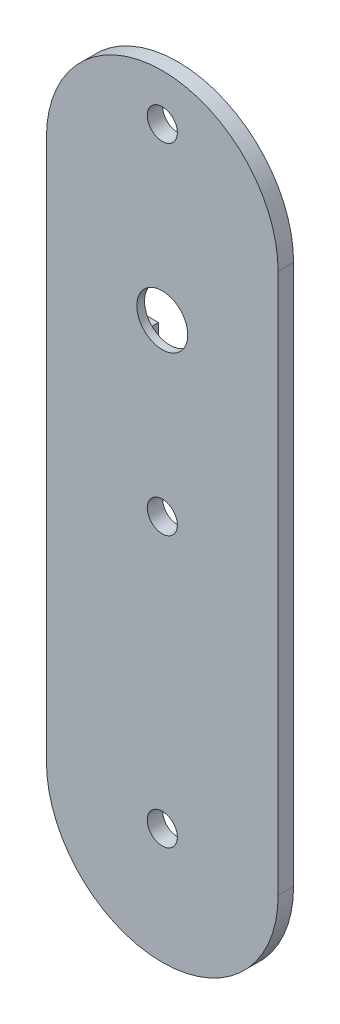
ISO-10303-21;
HEADER;
FILE_DESCRIPTION(('STEP AP214'),'2;1');
FILE_NAME('part.step','',(''),(''),'','','');
FILE_SCHEMA(('AUTOMOTIVE_DESIGN { 1 0 10303 214 1 1 1 1 }'));
ENDSEC;
DATA;
#1=APPLICATION_CONTEXT('core data for automotive mechanical design processes');
#2=APPLICATION_PROTOCOL_DEFINITION('international standard','automotive_design',2000,#1);
#3=PRODUCT_CONTEXT('',#1,'mechanical');
#4=PRODUCT('Part','Part','',(#3));
#5=PRODUCT_RELATED_PRODUCT_CATEGORY('part','',(#4));
#6=PRODUCT_DEFINITION_FORMATION('','',#4);
#7=PRODUCT_DEFINITION_CONTEXT('part definition',#1,'design');
#8=PRODUCT_DEFINITION('design','',#6,#7);
#9=PRODUCT_DEFINITION_SHAPE('','',#8);
#10=(LENGTH_UNIT() NAMED_UNIT(*) SI_UNIT(.MILLI.,.METRE.));
#11=(NAMED_UNIT(*) PLANE_ANGLE_UNIT() SI_UNIT($,.RADIAN.));
#12=(NAMED_UNIT(*) SI_UNIT($,.STERADIAN.) SOLID_ANGLE_UNIT());
#13=UNCERTAINTY_MEASURE_WITH_UNIT(LENGTH_MEASURE(1.E-05),#10,'distance_accuracy_value','');
#14=(GEOMETRIC_REPRESENTATION_CONTEXT(3) GLOBAL_UNCERTAINTY_ASSIGNED_CONTEXT((#13)) GLOBAL_UNIT_ASSIGNED_CONTEXT((#10,
#11,#12)) REPRESENTATION_CONTEXT('',''));
#15=CARTESIAN_POINT('',(0.,0.,0.));
#16=DIRECTION('',(0.,0.,1.));
#17=DIRECTION('',(1.,0.,0.));
#18=AXIS2_PLACEMENT_3D('',#15,#16,#17);
#19=CARTESIAN_POINT('',(0.,0.,0.));
#20=DIRECTION('',(0.,0.,1.));
#21=DIRECTION('',(1.,0.,0.));
#22=AXIS2_PLACEMENT_3D('',#19,#20,#21);
#23=PLANE('',#22);
#24=CARTESIAN_POINT('',(15.,0.,0.));
#25=DIRECTION('',(0.,0.,-1.));
#26=DIRECTION('',(-1.,0.,0.));
#27=AXIS2_PLACEMENT_3D('',#24,#25,#26);
#28=CIRCLE('',#27,1.94999999999999);
#29=CARTESIAN_POINT('',(13.05,0.,0.));
#30=VERTEX_POINT('',#29);
#31=EDGE_CURVE('E534',#30,#30,#28,.T.);
#32=ORIENTED_EDGE('',*,*,#31,.F.);
#33=EDGE_LOOP('',(#32));
#34=FACE_BOUND('',#33,.T.);
#35=CARTESIAN_POINT('',(15.,0.,0.));
#36=DIRECTION('',(0.,0.,1.));
#37=DIRECTION('',(1.,0.,0.));
#38=AXIS2_PLACEMENT_3D('',#35,#36,#37);
#39=CIRCLE('',#38,15.);
#40=CARTESIAN_POINT('',(30.,0.,0.));
#41=VERTEX_POINT('',#40);
#42=CARTESIAN_POINT('',(0.,0.,0.));
#43=VERTEX_POINT('',#42);
#44=EDGE_CURVE('E266',#41,#43,#39,.F.);
#45=ORIENTED_EDGE('',*,*,#44,.T.);
#46=DIRECTION('',(0.,1.,0.));
#47=VECTOR('',#46,1.);
#48=CARTESIAN_POINT('',(0.,0.,0.));
#49=LINE('',#48,#47);
#50=CARTESIAN_POINT('',(0.,70.,0.));
#51=VERTEX_POINT('',#50);
#52=EDGE_CURVE('E270',#43,#51,#49,.T.);
#53=ORIENTED_EDGE('',*,*,#52,.T.);
#54=CARTESIAN_POINT('',(15.,70.,0.));
#55=DIRECTION('',(0.,0.,1.));
#56=DIRECTION('',(1.,0.,0.));
#57=AXIS2_PLACEMENT_3D('',#54,#55,#56);
#58=CIRCLE('',#57,15.);
#59=CARTESIAN_POINT('',(30.,70.,0.));
#60=VERTEX_POINT('',#59);
#61=EDGE_CURVE('E282',#51,#60,#58,.F.);
#62=ORIENTED_EDGE('',*,*,#61,.T.);
#63=DIRECTION('',(0.,-1.,0.));
#64=VECTOR('',#63,1.);
#65=CARTESIAN_POINT('',(30.,0.,0.));
#66=LINE('',#65,#64);
#67=EDGE_CURVE('E279',#60,#41,#66,.T.);
#68=ORIENTED_EDGE('',*,*,#67,.T.);
#69=EDGE_LOOP('',(#45,#53,#62,#68));
#70=FACE_BOUND('',#69,.T.);
#71=CARTESIAN_POINT('',(15.,35.,0.));
#72=DIRECTION('',(0.,0.,-1.));
#73=DIRECTION('',(-1.,0.,0.));
#74=AXIS2_PLACEMENT_3D('',#71,#72,#73);
#75=CIRCLE('',#74,1.94999999999999);
#76=CARTESIAN_POINT('',(13.05,35.,0.));
#77=VERTEX_POINT('',#76);
#78=EDGE_CURVE('E260',#77,#77,#75,.T.);
#79=ORIENTED_EDGE('',*,*,#78,.F.);
#80=EDGE_LOOP('',(#79));
#81=FACE_BOUND('',#80,.T.);
#82=CARTESIAN_POINT('',(15.,79.,0.));
#83=DIRECTION('',(0.,0.,-1.));
#84=DIRECTION('',(-1.,0.,0.));
#85=AXIS2_PLACEMENT_3D('',#82,#83,#84);
#86=CIRCLE('',#85,1.94999999999999);
#87=CARTESIAN_POINT('',(13.05,79.,0.));
#88=VERTEX_POINT('',#87);
#89=EDGE_CURVE('E235',#88,#88,#86,.T.);
#90=ORIENTED_EDGE('',*,*,#89,.F.);
#91=EDGE_LOOP('',(#90));
#92=FACE_BOUND('',#91,.T.);
#93=DIRECTION('',(0.,1.,0.));
#94=VECTOR('',#93,1.);
#95=CARTESIAN_POINT('',(17.5000000000006,1.94289029309409E-13,0.));
#96=LINE('',#95,#94);
#97=CARTESIAN_POINT('',(17.5,59.5,0.));
#98=VERTEX_POINT('',#97);
#99=CARTESIAN_POINT('',(17.4999999999999,69.5,0.));
#100=VERTEX_POINT('',#99);
#101=EDGE_CURVE('E51',#98,#100,#96,.T.);
#102=ORIENTED_EDGE('',*,*,#101,.T.);
#103=DIRECTION('',(1.,0.,0.));
#104=VECTOR('',#103,1.);
#105=CARTESIAN_POINT('',(-7.71605002114482E-13,69.4999999999998,0.));
#106=LINE('',#105,#104);
#107=CARTESIAN_POINT('',(12.4999999999999,69.5,0.));
#108=VERTEX_POINT('',#107);
#109=EDGE_CURVE('E170',#108,#100,#106,.T.);
#110=ORIENTED_EDGE('',*,*,#109,.F.);
#111=DIRECTION('',(0.,1.,0.));
#112=VECTOR('',#111,1.);
#113=CARTESIAN_POINT('',(12.5000000000006,1.30104260698267E-13,0.));
#114=LINE('',#113,#112);
#115=CARTESIAN_POINT('',(12.5,59.5,0.));
#116=VERTEX_POINT('',#115);
#117=EDGE_CURVE('E228',#116,#108,#114,.T.);
#118=ORIENTED_EDGE('',*,*,#117,.F.);
#119=DIRECTION('',(-1.,0.,0.));
#120=VECTOR('',#119,1.);
#121=CARTESIAN_POINT('',(0.,59.5,0.));
#122=LINE('',#121,#120);
#123=CARTESIAN_POINT('',(2.49999999999999,59.5,0.));
#124=VERTEX_POINT('',#123);
#125=EDGE_CURVE('E225',#116,#124,#122,.T.);
#126=ORIENTED_EDGE('',*,*,#125,.T.);
#127=DIRECTION('',(0.,1.,0.));
#128=VECTOR('',#127,1.);
#129=CARTESIAN_POINT('',(2.49999999999999,0.,0.));
#130=LINE('',#129,#128);
#131=CARTESIAN_POINT('',(2.49999999999999,54.5,0.));
#132=VERTEX_POINT('',#131);
#133=EDGE_CURVE('E222',#132,#124,#130,.T.);
#134=ORIENTED_EDGE('',*,*,#133,.F.);
#135=DIRECTION('',(-1.,0.,0.));
#136=VECTOR('',#135,1.);
#137=CARTESIAN_POINT('',(0.,54.5,0.));
#138=LINE('',#137,#136);
#139=CARTESIAN_POINT('',(12.5,54.5,0.));
#140=VERTEX_POINT('',#139);
#141=EDGE_CURVE('E219',#140,#132,#138,.T.);
#142=ORIENTED_EDGE('',*,*,#141,.F.);
#143=DIRECTION('',(0.,-1.,0.));
#144=VECTOR('',#143,1.);
#145=CARTESIAN_POINT('',(12.5000000000002,0.,0.));
#146=LINE('',#145,#144);
#147=CARTESIAN_POINT('',(12.5,44.5,0.));
#148=VERTEX_POINT('',#147);
#149=EDGE_CURVE('E216',#140,#148,#146,.T.);
#150=ORIENTED_EDGE('',*,*,#149,.T.);
#151=DIRECTION('',(-1.,0.,0.));
#152=VECTOR('',#151,1.);
#153=CARTESIAN_POINT('',(-1.85268467234323E-13,44.4999999999999,0.));
#154=LINE('',#153,#152);
#155=CARTESIAN_POINT('',(17.5,44.5,0.));
#156=VERTEX_POINT('',#155);
#157=EDGE_CURVE('E213',#156,#148,#154,.T.);
#158=ORIENTED_EDGE('',*,*,#157,.F.);
#159=DIRECTION('',(0.,-1.,0.));
#160=VECTOR('',#159,1.);
#161=CARTESIAN_POINT('',(17.5000000000002,0.,0.));
#162=LINE('',#161,#160);
#163=CARTESIAN_POINT('',(17.5,54.5,0.));
#164=VERTEX_POINT('',#163);
#165=EDGE_CURVE('E210',#164,#156,#162,.T.);
#166=ORIENTED_EDGE('',*,*,#165,.F.);
#167=DIRECTION('',(1.,0.,0.));
#168=VECTOR('',#167,1.);
#169=CARTESIAN_POINT('',(-4.15986689539237E-13,54.4999999999999,0.));
#170=LINE('',#169,#168);
#171=CARTESIAN_POINT('',(27.5,54.5000000000001,0.));
#172=VERTEX_POINT('',#171);
#173=EDGE_CURVE('E207',#164,#172,#170,.T.);
#174=ORIENTED_EDGE('',*,*,#173,.T.);
#175=DIRECTION('',(0.,-1.,0.));
#176=VECTOR('',#175,1.);
#177=CARTESIAN_POINT('',(27.5000000000004,1.90819582357452E-13,0.));
#178=LINE('',#177,#176);
#179=CARTESIAN_POINT('',(27.5,59.5000000000001,0.));
#180=VERTEX_POINT('',#179);
#181=EDGE_CURVE('E204',#180,#172,#178,.T.);
#182=ORIENTED_EDGE('',*,*,#181,.F.);
#183=DIRECTION('',(1.,0.,0.));
#184=VECTOR('',#183,1.);
#185=CARTESIAN_POINT('',(-4.12864187282479E-13,59.4999999999999,0.));
#186=LINE('',#185,#184);
#187=EDGE_CURVE('E201',#98,#180,#186,.T.);
#188=ORIENTED_EDGE('',*,*,#187,.F.);
#189=EDGE_LOOP('',(#102,#110,#118,#126,#134,#142,#150,#158,#166,#174,#182,#188));
#190=FACE_BOUND('',#189,.T.);
#191=ADVANCED_FACE('F35',(#34,#70,#81,#92,#190),#23,.F.);
#192=CARTESIAN_POINT('',(15.,0.,2.));
#193=DIRECTION('',(0.,0.,-1.));
#194=DIRECTION('',(-1.,0.,0.));
#195=AXIS2_PLACEMENT_3D('',#192,#193,#194);
#196=CYLINDRICAL_SURFACE('',#195,15.);
#197=ORIENTED_EDGE('',*,*,#44,.F.);
#198=DIRECTION('',(0.,0.,-1.));
#199=VECTOR('',#198,1.);
#200=CARTESIAN_POINT('',(30.,0.,2.));
#201=LINE('',#200,#199);
#202=CARTESIAN_POINT('',(30.,0.,2.));
#203=VERTEX_POINT('',#202);
#204=EDGE_CURVE('E11',#203,#41,#201,.T.);
#205=ORIENTED_EDGE('',*,*,#204,.F.);
#206=CARTESIAN_POINT('',(15.,0.,2.));
#207=DIRECTION('',(0.,0.,1.));
#208=DIRECTION('',(1.,0.,0.));
#209=AXIS2_PLACEMENT_3D('',#206,#207,#208);
#210=CIRCLE('',#209,15.);
#211=CARTESIAN_POINT('',(0.,0.,2.));
#212=VERTEX_POINT('',#211);
#213=EDGE_CURVE('E267',#203,#212,#210,.F.);
#214=ORIENTED_EDGE('',*,*,#213,.T.);
#215=DIRECTION('',(0.,0.,-1.));
#216=VECTOR('',#215,1.);
#217=CARTESIAN_POINT('',(0.,0.,2.));
#218=LINE('',#217,#216);
#219=EDGE_CURVE('E60',#212,#43,#218,.T.);
#220=ORIENTED_EDGE('',*,*,#219,.T.);
#221=EDGE_LOOP('',(#197,#205,#214,#220));
#222=FACE_BOUND('',#221,.T.);
#223=ADVANCED_FACE('F37',(#222),#196,.T.);
#224=CARTESIAN_POINT('',(30.,0.,2.));
#225=DIRECTION('',(1.,0.,0.));
#226=DIRECTION('',(0.,1.,0.));
#227=AXIS2_PLACEMENT_3D('',#224,#225,#226);
#228=PLANE('',#227);
#229=ORIENTED_EDGE('',*,*,#67,.F.);
#230=DIRECTION('',(0.,0.,-1.));
#231=VECTOR('',#230,1.);
#232=CARTESIAN_POINT('',(30.,70.,2.));
#233=LINE('',#232,#231);
#234=CARTESIAN_POINT('',(30.,70.,2.));
#235=VERTEX_POINT('',#234);
#236=EDGE_CURVE('E44',#235,#60,#233,.T.);
#237=ORIENTED_EDGE('',*,*,#236,.F.);
#238=DIRECTION('',(0.,-1.,0.));
#239=VECTOR('',#238,1.);
#240=CARTESIAN_POINT('',(30.,0.,2.));
#241=LINE('',#240,#239);
#242=EDGE_CURVE('E269',#235,#203,#241,.T.);
#243=ORIENTED_EDGE('',*,*,#242,.T.);
#244=ORIENTED_EDGE('',*,*,#204,.T.);
#245=EDGE_LOOP('',(#229,#237,#243,#244));
#246=FACE_BOUND('',#245,.T.);
#247=ADVANCED_FACE('F297',(#246),#228,.T.);
#248=CARTESIAN_POINT('',(15.,70.,2.));
#249=DIRECTION('',(0.,0.,-1.));
#250=DIRECTION('',(-1.,0.,0.));
#251=AXIS2_PLACEMENT_3D('',#248,#249,#250);
#252=CYLINDRICAL_SURFACE('',#251,15.);
#253=ORIENTED_EDGE('',*,*,#61,.F.);
#254=DIRECTION('',(0.,0.,-1.));
#255=VECTOR('',#254,1.);
#256=CARTESIAN_POINT('',(0.,70.,2.));
#257=LINE('',#256,#255);
#258=CARTESIAN_POINT('',(0.,70.,2.));
#259=VERTEX_POINT('',#258);
#260=EDGE_CURVE('E288',#259,#51,#257,.T.);
#261=ORIENTED_EDGE('',*,*,#260,.F.);
#262=CARTESIAN_POINT('',(15.,70.,2.));
#263=DIRECTION('',(0.,0.,1.));
#264=DIRECTION('',(1.,0.,0.));
#265=AXIS2_PLACEMENT_3D('',#262,#263,#264);
#266=CIRCLE('',#265,15.);
#267=EDGE_CURVE('E273',#259,#235,#266,.F.);
#268=ORIENTED_EDGE('',*,*,#267,.T.);
#269=ORIENTED_EDGE('',*,*,#236,.T.);
#270=EDGE_LOOP('',(#253,#261,#268,#269));
#271=FACE_BOUND('',#270,.T.);
#272=ADVANCED_FACE('F293',(#271),#252,.T.);
#273=CARTESIAN_POINT('',(0.,0.,2.));
#274=DIRECTION('',(-1.,0.,0.));
#275=DIRECTION('',(0.,0.,1.));
#276=AXIS2_PLACEMENT_3D('',#273,#274,#275);
#277=PLANE('',#276);
#278=ORIENTED_EDGE('',*,*,#52,.F.);
#279=ORIENTED_EDGE('',*,*,#219,.F.);
#280=DIRECTION('',(0.,1.,0.));
#281=VECTOR('',#280,1.);
#282=CARTESIAN_POINT('',(0.,0.,2.));
#283=LINE('',#282,#281);
#284=EDGE_CURVE('E276',#212,#259,#283,.T.);
#285=ORIENTED_EDGE('',*,*,#284,.T.);
#286=ORIENTED_EDGE('',*,*,#260,.T.);
#287=EDGE_LOOP('',(#278,#279,#285,#286));
#288=FACE_BOUND('',#287,.T.);
#289=ADVANCED_FACE('F300',(#288),#277,.T.);
#290=CARTESIAN_POINT('',(0.,0.,2.));
#291=DIRECTION('',(0.,0.,1.));
#292=DIRECTION('',(1.,0.,0.));
#293=AXIS2_PLACEMENT_3D('',#290,#291,#292);
#294=PLANE('',#293);
#295=CARTESIAN_POINT('',(15.,57.,2.));
#296=DIRECTION('',(0.,0.,-1.));
#297=DIRECTION('',(-1.,0.,0.));
#298=AXIS2_PLACEMENT_3D('',#295,#296,#297);
#299=CIRCLE('',#298,3.29999999999999);
#300=CARTESIAN_POINT('',(11.7,57.,2.));
#301=VERTEX_POINT('',#300);
#302=EDGE_CURVE('E532',#301,#301,#299,.T.);
#303=ORIENTED_EDGE('',*,*,#302,.T.);
#304=EDGE_LOOP('',(#303));
#305=FACE_BOUND('',#304,.T.);
#306=CARTESIAN_POINT('',(15.,0.,2.));
#307=DIRECTION('',(0.,0.,-1.));
#308=DIRECTION('',(-1.,0.,0.));
#309=AXIS2_PLACEMENT_3D('',#306,#307,#308);
#310=CIRCLE('',#309,1.94999999999999);
#311=CARTESIAN_POINT('',(13.05,0.,2.));
#312=VERTEX_POINT('',#311);
#313=EDGE_CURVE('E202',#312,#312,#310,.T.);
#314=ORIENTED_EDGE('',*,*,#313,.T.);
#315=EDGE_LOOP('',(#314));
#316=FACE_BOUND('',#315,.T.);
#317=CARTESIAN_POINT('',(15.,79.,2.));
#318=DIRECTION('',(0.,0.,-1.));
#319=DIRECTION('',(-1.,0.,0.));
#320=AXIS2_PLACEMENT_3D('',#317,#318,#319);
#321=CIRCLE('',#320,1.94999999999999);
#322=CARTESIAN_POINT('',(13.05,79.,2.));
#323=VERTEX_POINT('',#322);
#324=EDGE_CURVE('E257',#323,#323,#321,.T.);
#325=ORIENTED_EDGE('',*,*,#324,.T.);
#326=EDGE_LOOP('',(#325));
#327=FACE_BOUND('',#326,.T.);
#328=CARTESIAN_POINT('',(15.,35.,2.));
#329=DIRECTION('',(0.,0.,-1.));
#330=DIRECTION('',(-1.,0.,0.));
#331=AXIS2_PLACEMENT_3D('',#328,#329,#330);
#332=CIRCLE('',#331,1.94999999999999);
#333=CARTESIAN_POINT('',(13.05,35.,2.));
#334=VERTEX_POINT('',#333);
#335=EDGE_CURVE('E263',#334,#334,#332,.T.);
#336=ORIENTED_EDGE('',*,*,#335,.T.);
#337=EDGE_LOOP('',(#336));
#338=FACE_BOUND('',#337,.T.);
#339=ORIENTED_EDGE('',*,*,#213,.F.);
#340=ORIENTED_EDGE('',*,*,#242,.F.);
#341=ORIENTED_EDGE('',*,*,#267,.F.);
#342=ORIENTED_EDGE('',*,*,#284,.F.);
#343=EDGE_LOOP('',(#339,#340,#341,#342));
#344=FACE_BOUND('',#343,.T.);
#345=ADVANCED_FACE('F303',(#305,#316,#327,#338,#344),#294,.T.);
#346=CARTESIAN_POINT('',(15.,35.,0.));
#347=DIRECTION('',(0.,0.,-1.));
#348=DIRECTION('',(-1.,0.,0.));
#349=AXIS2_PLACEMENT_3D('',#346,#347,#348);
#350=CYLINDRICAL_SURFACE('',#349,1.94999999999999);
#351=ORIENTED_EDGE('',*,*,#335,.F.);
#352=EDGE_LOOP('',(#351));
#353=FACE_BOUND('',#352,.T.);
#354=ORIENTED_EDGE('',*,*,#78,.T.);
#355=EDGE_LOOP('',(#354));
#356=FACE_BOUND('',#355,.T.);
#357=ADVANCED_FACE('F335',(#353,#356),#350,.F.);
#358=CARTESIAN_POINT('',(15.,79.,0.));
#359=DIRECTION('',(0.,0.,-1.));
#360=DIRECTION('',(-1.,0.,0.));
#361=AXIS2_PLACEMENT_3D('',#358,#359,#360);
#362=CYLINDRICAL_SURFACE('',#361,1.94999999999999);
#363=ORIENTED_EDGE('',*,*,#324,.F.);
#364=EDGE_LOOP('',(#363));
#365=FACE_BOUND('',#364,.T.);
#366=ORIENTED_EDGE('',*,*,#89,.T.);
#367=EDGE_LOOP('',(#366));
#368=FACE_BOUND('',#367,.T.);
#369=ADVANCED_FACE('F343',(#365,#368),#362,.F.);
#370=CARTESIAN_POINT('',(17.5000000000006,1.94289029309409E-13,1.));
#371=DIRECTION('',(-1.,0.,0.));
#372=DIRECTION('',(0.,-1.,0.));
#373=AXIS2_PLACEMENT_3D('',#370,#371,#372);
#374=PLANE('',#373);
#375=ORIENTED_EDGE('',*,*,#101,.F.);
#376=DIRECTION('',(0.,0.,-1.));
#377=VECTOR('',#376,1.);
#378=CARTESIAN_POINT('',(17.5,59.5,1.));
#379=LINE('',#378,#377);
#380=CARTESIAN_POINT('',(17.5,59.5,1.));
#381=VERTEX_POINT('',#380);
#382=EDGE_CURVE('E150',#381,#98,#379,.T.);
#383=ORIENTED_EDGE('',*,*,#382,.F.);
#384=DIRECTION('',(0.,1.,0.));
#385=VECTOR('',#384,1.);
#386=CARTESIAN_POINT('',(17.5000000000006,1.94289029309409E-13,1.));
#387=LINE('',#386,#385);
#388=CARTESIAN_POINT('',(17.4999999999999,69.5,1.));
#389=VERTEX_POINT('',#388);
#390=EDGE_CURVE('E153',#381,#389,#387,.T.);
#391=ORIENTED_EDGE('',*,*,#390,.T.);
#392=DIRECTION('',(0.,0.,-1.));
#393=VECTOR('',#392,1.);
#394=CARTESIAN_POINT('',(17.4999999999999,69.5,1.));
#395=LINE('',#394,#393);
#396=EDGE_CURVE('E233',#389,#100,#395,.T.);
#397=ORIENTED_EDGE('',*,*,#396,.T.);
#398=EDGE_LOOP('',(#375,#383,#391,#397));
#399=FACE_BOUND('',#398,.T.);
#400=ADVANCED_FACE('F152',(#399),#374,.T.);
#401=CARTESIAN_POINT('',(-7.71605002114482E-13,69.4999999999998,1.));
#402=DIRECTION('',(0.,1.,0.));
#403=DIRECTION('',(-1.,0.,0.));
#404=AXIS2_PLACEMENT_3D('',#401,#402,#403);
#405=PLANE('',#404);
#406=ORIENTED_EDGE('',*,*,#109,.T.);
#407=ORIENTED_EDGE('',*,*,#396,.F.);
#408=DIRECTION('',(1.,0.,0.));
#409=VECTOR('',#408,1.);
#410=CARTESIAN_POINT('',(-7.71605002114482E-13,69.4999999999998,1.));
#411=LINE('',#410,#409);
#412=CARTESIAN_POINT('',(12.4999999999999,69.5,1.));
#413=VERTEX_POINT('',#412);
#414=EDGE_CURVE('E160',#413,#389,#411,.T.);
#415=ORIENTED_EDGE('',*,*,#414,.F.);
#416=DIRECTION('',(0.,0.,-1.));
#417=VECTOR('',#416,1.);
#418=CARTESIAN_POINT('',(12.4999999999999,69.5,1.));
#419=LINE('',#418,#417);
#420=EDGE_CURVE('E236',#413,#108,#419,.T.);
#421=ORIENTED_EDGE('',*,*,#420,.T.);
#422=EDGE_LOOP('',(#406,#407,#415,#421));
#423=FACE_BOUND('',#422,.T.);
#424=ADVANCED_FACE('F357',(#423),#405,.F.);
#425=CARTESIAN_POINT('',(12.5000000000006,1.30104260698267E-13,1.));
#426=DIRECTION('',(-1.,0.,0.));
#427=DIRECTION('',(0.,-1.,0.));
#428=AXIS2_PLACEMENT_3D('',#425,#426,#427);
#429=PLANE('',#428);
#430=ORIENTED_EDGE('',*,*,#117,.T.);
#431=ORIENTED_EDGE('',*,*,#420,.F.);
#432=DIRECTION('',(0.,1.,0.));
#433=VECTOR('',#432,1.);
#434=CARTESIAN_POINT('',(12.5000000000006,1.30104260698267E-13,1.));
#435=LINE('',#434,#433);
#436=CARTESIAN_POINT('',(12.5,59.5,1.));
#437=VERTEX_POINT('',#436);
#438=EDGE_CURVE('E197',#437,#413,#435,.T.);
#439=ORIENTED_EDGE('',*,*,#438,.F.);
#440=DIRECTION('',(0.,0.,-1.));
#441=VECTOR('',#440,1.);
#442=CARTESIAN_POINT('',(12.5,59.5,1.));
#443=LINE('',#442,#441);
#444=EDGE_CURVE('E238',#437,#116,#443,.T.);
#445=ORIENTED_EDGE('',*,*,#444,.T.);
#446=EDGE_LOOP('',(#430,#431,#439,#445));
#447=FACE_BOUND('',#446,.T.);
#448=ADVANCED_FACE('F364',(#447),#429,.F.);
#449=CARTESIAN_POINT('',(0.,59.5,1.));
#450=DIRECTION('',(0.,-1.,0.));
#451=DIRECTION('',(0.,0.,-1.));
#452=AXIS2_PLACEMENT_3D('',#449,#450,#451);
#453=PLANE('',#452);
#454=ORIENTED_EDGE('',*,*,#125,.F.);
#455=ORIENTED_EDGE('',*,*,#444,.F.);
#456=DIRECTION('',(-1.,0.,0.));
#457=VECTOR('',#456,1.);
#458=CARTESIAN_POINT('',(0.,59.5,1.));
#459=LINE('',#458,#457);
#460=CARTESIAN_POINT('',(2.49999999999999,59.5,1.));
#461=VERTEX_POINT('',#460);
#462=EDGE_CURVE('E195',#437,#461,#459,.T.);
#463=ORIENTED_EDGE('',*,*,#462,.T.);
#464=DIRECTION('',(0.,0.,-1.));
#465=VECTOR('',#464,1.);
#466=CARTESIAN_POINT('',(2.49999999999999,59.5,1.));
#467=LINE('',#466,#465);
#468=EDGE_CURVE('E240',#461,#124,#467,.T.);
#469=ORIENTED_EDGE('',*,*,#468,.T.);
#470=EDGE_LOOP('',(#454,#455,#463,#469));
#471=FACE_BOUND('',#470,.T.);
#472=ADVANCED_FACE('F372',(#471),#453,.T.);
#473=CARTESIAN_POINT('',(2.49999999999999,0.,1.));
#474=DIRECTION('',(-1.,0.,0.));
#475=DIRECTION('',(0.,0.,1.));
#476=AXIS2_PLACEMENT_3D('',#473,#474,#475);
#477=PLANE('',#476);
#478=ORIENTED_EDGE('',*,*,#133,.T.);
#479=ORIENTED_EDGE('',*,*,#468,.F.);
#480=DIRECTION('',(0.,1.,0.));
#481=VECTOR('',#480,1.);
#482=CARTESIAN_POINT('',(2.49999999999999,0.,1.));
#483=LINE('',#482,#481);
#484=CARTESIAN_POINT('',(2.49999999999999,54.5,1.));
#485=VERTEX_POINT('',#484);
#486=EDGE_CURVE('E192',#485,#461,#483,.T.);
#487=ORIENTED_EDGE('',*,*,#486,.F.);
#488=DIRECTION('',(0.,0.,-1.));
#489=VECTOR('',#488,1.);
#490=CARTESIAN_POINT('',(2.49999999999999,54.5,1.));
#491=LINE('',#490,#489);
#492=EDGE_CURVE('E242',#485,#132,#491,.T.);
#493=ORIENTED_EDGE('',*,*,#492,.T.);
#494=EDGE_LOOP('',(#478,#479,#487,#493));
#495=FACE_BOUND('',#494,.T.);
#496=ADVANCED_FACE('F380',(#495),#477,.F.);
#497=CARTESIAN_POINT('',(0.,54.5,1.));
#498=DIRECTION('',(0.,-1.,0.));
#499=DIRECTION('',(0.,0.,-1.));
#500=AXIS2_PLACEMENT_3D('',#497,#498,#499);
#501=PLANE('',#500);
#502=ORIENTED_EDGE('',*,*,#141,.T.);
#503=ORIENTED_EDGE('',*,*,#492,.F.);
#504=DIRECTION('',(-1.,0.,0.));
#505=VECTOR('',#504,1.);
#506=CARTESIAN_POINT('',(0.,54.5,1.));
#507=LINE('',#506,#505);
#508=CARTESIAN_POINT('',(12.5,54.5,1.));
#509=VERTEX_POINT('',#508);
#510=EDGE_CURVE('E189',#509,#485,#507,.T.);
#511=ORIENTED_EDGE('',*,*,#510,.F.);
#512=DIRECTION('',(0.,0.,-1.));
#513=VECTOR('',#512,1.);
#514=CARTESIAN_POINT('',(12.5,54.5,1.));
#515=LINE('',#514,#513);
#516=EDGE_CURVE('E244',#509,#140,#515,.T.);
#517=ORIENTED_EDGE('',*,*,#516,.T.);
#518=EDGE_LOOP('',(#502,#503,#511,#517));
#519=FACE_BOUND('',#518,.T.);
#520=ADVANCED_FACE('F388',(#519),#501,.F.);
#521=CARTESIAN_POINT('',(12.5000000000002,0.,1.));
#522=DIRECTION('',(1.,0.,0.));
#523=DIRECTION('',(0.,1.,0.));
#524=AXIS2_PLACEMENT_3D('',#521,#522,#523);
#525=PLANE('',#524);
#526=ORIENTED_EDGE('',*,*,#149,.F.);
#527=ORIENTED_EDGE('',*,*,#516,.F.);
#528=DIRECTION('',(0.,-1.,0.));
#529=VECTOR('',#528,1.);
#530=CARTESIAN_POINT('',(12.5000000000002,0.,1.));
#531=LINE('',#530,#529);
#532=CARTESIAN_POINT('',(12.5,44.5,1.));
#533=VERTEX_POINT('',#532);
#534=EDGE_CURVE('E187',#509,#533,#531,.T.);
#535=ORIENTED_EDGE('',*,*,#534,.T.);
#536=DIRECTION('',(0.,0.,-1.));
#537=VECTOR('',#536,1.);
#538=CARTESIAN_POINT('',(12.5,44.5,1.));
#539=LINE('',#538,#537);
#540=EDGE_CURVE('E246',#533,#148,#539,.T.);
#541=ORIENTED_EDGE('',*,*,#540,.T.);
#542=EDGE_LOOP('',(#526,#527,#535,#541));
#543=FACE_BOUND('',#542,.T.);
#544=ADVANCED_FACE('F396',(#543),#525,.T.);
#545=CARTESIAN_POINT('',(-1.85268467234323E-13,44.4999999999999,1.));
#546=DIRECTION('',(0.,-1.,0.));
#547=DIRECTION('',(1.,0.,0.));
#548=AXIS2_PLACEMENT_3D('',#545,#546,#547);
#549=PLANE('',#548);
#550=ORIENTED_EDGE('',*,*,#157,.T.);
#551=ORIENTED_EDGE('',*,*,#540,.F.);
#552=DIRECTION('',(-1.,0.,0.));
#553=VECTOR('',#552,1.);
#554=CARTESIAN_POINT('',(-1.85268467234323E-13,44.4999999999999,1.));
#555=LINE('',#554,#553);
#556=CARTESIAN_POINT('',(17.5,44.5,1.));
#557=VERTEX_POINT('',#556);
#558=EDGE_CURVE('E184',#557,#533,#555,.T.);
#559=ORIENTED_EDGE('',*,*,#558,.F.);
#560=DIRECTION('',(0.,0.,-1.));
#561=VECTOR('',#560,1.);
#562=CARTESIAN_POINT('',(17.5,44.5,1.));
#563=LINE('',#562,#561);
#564=EDGE_CURVE('E248',#557,#156,#563,.T.);
#565=ORIENTED_EDGE('',*,*,#564,.T.);
#566=EDGE_LOOP('',(#550,#551,#559,#565));
#567=FACE_BOUND('',#566,.T.);
#568=ADVANCED_FACE('F404',(#567),#549,.F.);
#569=CARTESIAN_POINT('',(17.5000000000002,0.,1.));
#570=DIRECTION('',(1.,0.,0.));
#571=DIRECTION('',(0.,1.,0.));
#572=AXIS2_PLACEMENT_3D('',#569,#570,#571);
#573=PLANE('',#572);
#574=ORIENTED_EDGE('',*,*,#165,.T.);
#575=ORIENTED_EDGE('',*,*,#564,.F.);
#576=DIRECTION('',(0.,-1.,0.));
#577=VECTOR('',#576,1.);
#578=CARTESIAN_POINT('',(17.5000000000002,0.,1.));
#579=LINE('',#578,#577);
#580=CARTESIAN_POINT('',(17.5,54.5,1.));
#581=VERTEX_POINT('',#580);
#582=EDGE_CURVE('E181',#581,#557,#579,.T.);
#583=ORIENTED_EDGE('',*,*,#582,.F.);
#584=DIRECTION('',(0.,0.,-1.));
#585=VECTOR('',#584,1.);
#586=CARTESIAN_POINT('',(17.5,54.5,1.));
#587=LINE('',#586,#585);
#588=EDGE_CURVE('E250',#581,#164,#587,.T.);
#589=ORIENTED_EDGE('',*,*,#588,.T.);
#590=EDGE_LOOP('',(#574,#575,#583,#589));
#591=FACE_BOUND('',#590,.T.);
#592=ADVANCED_FACE('F412',(#591),#573,.F.);
#593=CARTESIAN_POINT('',(-4.15986689539237E-13,54.4999999999999,1.));
#594=DIRECTION('',(0.,1.,0.));
#595=DIRECTION('',(-1.,0.,0.));
#596=AXIS2_PLACEMENT_3D('',#593,#594,#595);
#597=PLANE('',#596);
#598=ORIENTED_EDGE('',*,*,#173,.F.);
#599=ORIENTED_EDGE('',*,*,#588,.F.);
#600=DIRECTION('',(1.,0.,0.));
#601=VECTOR('',#600,1.);
#602=CARTESIAN_POINT('',(-4.15986689539237E-13,54.4999999999999,1.));
#603=LINE('',#602,#601);
#604=CARTESIAN_POINT('',(27.5,54.5000000000001,1.));
#605=VERTEX_POINT('',#604);
#606=EDGE_CURVE('E176',#581,#605,#603,.T.);
#607=ORIENTED_EDGE('',*,*,#606,.T.);
#608=DIRECTION('',(0.,0.,-1.));
#609=VECTOR('',#608,1.);
#610=CARTESIAN_POINT('',(27.5,54.5000000000001,1.));
#611=LINE('',#610,#609);
#612=EDGE_CURVE('E252',#605,#172,#611,.T.);
#613=ORIENTED_EDGE('',*,*,#612,.T.);
#614=EDGE_LOOP('',(#598,#599,#607,#613));
#615=FACE_BOUND('',#614,.T.);
#616=ADVANCED_FACE('F420',(#615),#597,.T.);
#617=CARTESIAN_POINT('',(27.5000000000004,1.90819582357452E-13,1.));
#618=DIRECTION('',(1.,0.,0.));
#619=DIRECTION('',(0.,1.,0.));
#620=AXIS2_PLACEMENT_3D('',#617,#618,#619);
#621=PLANE('',#620);
#622=ORIENTED_EDGE('',*,*,#181,.T.);
#623=ORIENTED_EDGE('',*,*,#612,.F.);
#624=DIRECTION('',(0.,-1.,0.));
#625=VECTOR('',#624,1.);
#626=CARTESIAN_POINT('',(27.5000000000004,1.90819582357452E-13,1.));
#627=LINE('',#626,#625);
#628=CARTESIAN_POINT('',(27.5,59.5000000000001,1.));
#629=VERTEX_POINT('',#628);
#630=EDGE_CURVE('E174',#629,#605,#627,.T.);
#631=ORIENTED_EDGE('',*,*,#630,.F.);
#632=DIRECTION('',(0.,0.,-1.));
#633=VECTOR('',#632,1.);
#634=CARTESIAN_POINT('',(27.5,59.5000000000001,1.));
#635=LINE('',#634,#633);
#636=EDGE_CURVE('E159',#629,#180,#635,.T.);
#637=ORIENTED_EDGE('',*,*,#636,.T.);
#638=EDGE_LOOP('',(#622,#623,#631,#637));
#639=FACE_BOUND('',#638,.T.);
#640=ADVANCED_FACE('F428',(#639),#621,.F.);
#641=CARTESIAN_POINT('',(-4.12864187282479E-13,59.4999999999999,1.));
#642=DIRECTION('',(0.,1.,0.));
#643=DIRECTION('',(-1.,0.,0.));
#644=AXIS2_PLACEMENT_3D('',#641,#642,#643);
#645=PLANE('',#644);
#646=ORIENTED_EDGE('',*,*,#187,.T.);
#647=ORIENTED_EDGE('',*,*,#636,.F.);
#648=DIRECTION('',(1.,0.,0.));
#649=VECTOR('',#648,1.);
#650=CARTESIAN_POINT('',(-4.12864187282479E-13,59.4999999999999,1.));
#651=LINE('',#650,#649);
#652=EDGE_CURVE('E167',#381,#629,#651,.T.);
#653=ORIENTED_EDGE('',*,*,#652,.F.);
#654=ORIENTED_EDGE('',*,*,#382,.T.);
#655=EDGE_LOOP('',(#646,#647,#653,#654));
#656=FACE_BOUND('',#655,.T.);
#657=ADVANCED_FACE('F172',(#656),#645,.F.);
#658=CARTESIAN_POINT('',(0.,0.,1.));
#659=DIRECTION('',(0.,0.,-1.));
#660=DIRECTION('',(-1.,0.,0.));
#661=AXIS2_PLACEMENT_3D('',#658,#659,#660);
#662=PLANE('',#661);
#663=CARTESIAN_POINT('',(15.,57.,1.));
#664=DIRECTION('',(0.,0.,-1.));
#665=DIRECTION('',(-1.,0.,0.));
#666=AXIS2_PLACEMENT_3D('',#663,#664,#665);
#667=CIRCLE('',#666,3.29999999999999);
#668=CARTESIAN_POINT('',(11.7,57.,1.));
#669=VERTEX_POINT('',#668);
#670=EDGE_CURVE('E39',#669,#669,#667,.T.);
#671=ORIENTED_EDGE('',*,*,#670,.F.);
#672=EDGE_LOOP('',(#671));
#673=FACE_BOUND('',#672,.T.);
#674=ORIENTED_EDGE('',*,*,#390,.F.);
#675=ORIENTED_EDGE('',*,*,#652,.T.);
#676=ORIENTED_EDGE('',*,*,#630,.T.);
#677=ORIENTED_EDGE('',*,*,#606,.F.);
#678=ORIENTED_EDGE('',*,*,#582,.T.);
#679=ORIENTED_EDGE('',*,*,#558,.T.);
#680=ORIENTED_EDGE('',*,*,#534,.F.);
#681=ORIENTED_EDGE('',*,*,#510,.T.);
#682=ORIENTED_EDGE('',*,*,#486,.T.);
#683=ORIENTED_EDGE('',*,*,#462,.F.);
#684=ORIENTED_EDGE('',*,*,#438,.T.);
#685=ORIENTED_EDGE('',*,*,#414,.T.);
#686=EDGE_LOOP('',(#674,#675,#676,#677,#678,#679,#680,#681,#682,#683,#684,#685));
#687=FACE_BOUND('',#686,.T.);
#688=ADVANCED_FACE('F165',(#673,#687),#662,.T.);
#689=CARTESIAN_POINT('',(15.,0.,0.));
#690=DIRECTION('',(0.,0.,-1.));
#691=DIRECTION('',(-1.,0.,0.));
#692=AXIS2_PLACEMENT_3D('',#689,#690,#691);
#693=CYLINDRICAL_SURFACE('',#692,1.94999999999999);
#694=ORIENTED_EDGE('',*,*,#313,.F.);
#695=EDGE_LOOP('',(#694));
#696=FACE_BOUND('',#695,.T.);
#697=ORIENTED_EDGE('',*,*,#31,.T.);
#698=EDGE_LOOP('',(#697));
#699=FACE_BOUND('',#698,.T.);
#700=ADVANCED_FACE('F448',(#696,#699),#693,.F.);
#701=CARTESIAN_POINT('',(15.,57.,0.));
#702=DIRECTION('',(0.,0.,-1.));
#703=DIRECTION('',(-1.,0.,0.));
#704=AXIS2_PLACEMENT_3D('',#701,#702,#703);
#705=CYLINDRICAL_SURFACE('',#704,3.29999999999999);
#706=ORIENTED_EDGE('',*,*,#670,.T.);
#707=EDGE_LOOP('',(#706));
#708=FACE_BOUND('',#707,.T.);
#709=ORIENTED_EDGE('',*,*,#302,.F.);
#710=EDGE_LOOP('',(#709));
#711=FACE_BOUND('',#710,.T.);
#712=ADVANCED_FACE('F456',(#708,#711),#705,.F.);
#713=CLOSED_SHELL('',(#191,#223,#247,#272,#289,#345,#357,#369,#400,#424,#448,#472,#496,#520,
#544,#568,#592,#616,#640,#657,#688,#700,#712));
#714=MANIFOLD_SOLID_BREP('B2',#713);
#715=ADVANCED_BREP_SHAPE_REPRESENTATION('',(#18,#714),#14);
#716=SHAPE_DEFINITION_REPRESENTATION(#9,#715);
ENDSEC;
END-ISO-10303-21;
